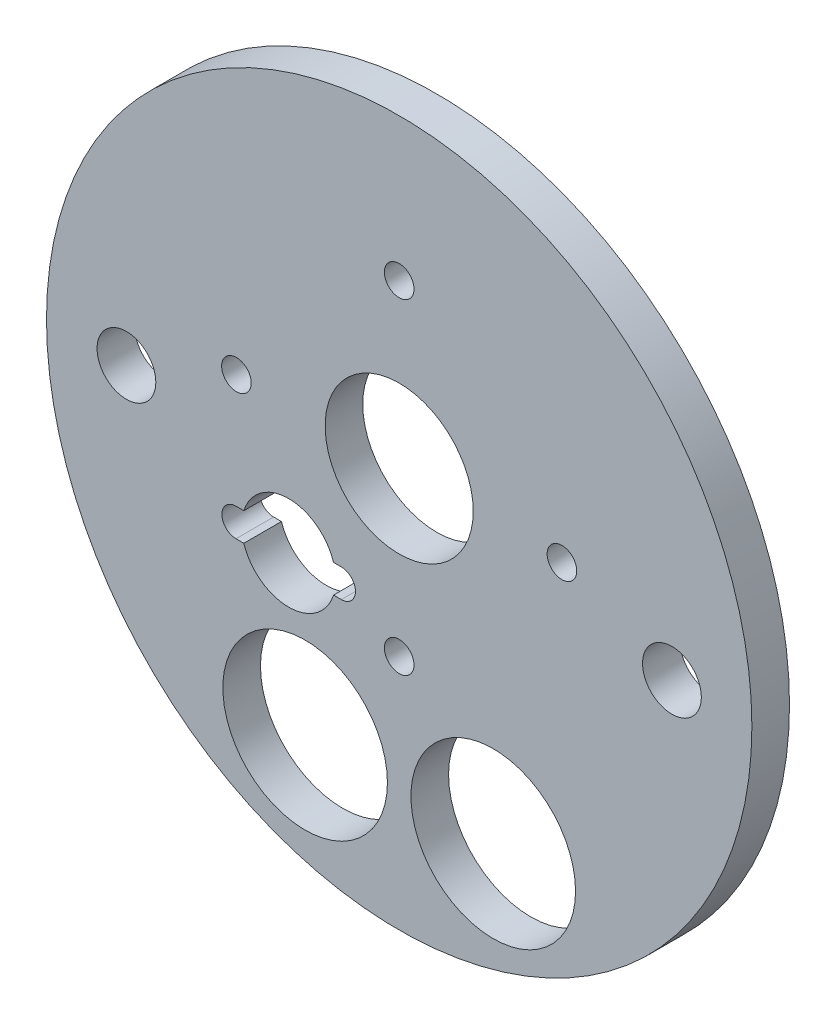
ISO-10303-21;
HEADER;
FILE_DESCRIPTION(('STEP AP214'),'2;1');
FILE_NAME('part.step','',(''),(''),'','','');
FILE_SCHEMA(('AUTOMOTIVE_DESIGN { 1 0 10303 214 1 1 1 1 }'));
ENDSEC;
DATA;
#1=APPLICATION_CONTEXT('core data for automotive mechanical design processes');
#2=APPLICATION_PROTOCOL_DEFINITION('international standard','automotive_design',2000,#1);
#3=PRODUCT_CONTEXT('',#1,'mechanical');
#4=PRODUCT('Part','Part','',(#3));
#5=PRODUCT_RELATED_PRODUCT_CATEGORY('part','',(#4));
#6=PRODUCT_DEFINITION_FORMATION('','',#4);
#7=PRODUCT_DEFINITION_CONTEXT('part definition',#1,'design');
#8=PRODUCT_DEFINITION('design','',#6,#7);
#9=PRODUCT_DEFINITION_SHAPE('','',#8);
#10=(LENGTH_UNIT() NAMED_UNIT(*) SI_UNIT(.MILLI.,.METRE.));
#11=(NAMED_UNIT(*) PLANE_ANGLE_UNIT() SI_UNIT($,.RADIAN.));
#12=(NAMED_UNIT(*) SI_UNIT($,.STERADIAN.) SOLID_ANGLE_UNIT());
#13=UNCERTAINTY_MEASURE_WITH_UNIT(LENGTH_MEASURE(1.E-05),#10,'distance_accuracy_value','');
#14=(GEOMETRIC_REPRESENTATION_CONTEXT(3) GLOBAL_UNCERTAINTY_ASSIGNED_CONTEXT((#13)) GLOBAL_UNIT_ASSIGNED_CONTEXT((#10,
#11,#12)) REPRESENTATION_CONTEXT('',''));
#15=CARTESIAN_POINT('',(0.,0.,0.));
#16=DIRECTION('',(0.,0.,1.));
#17=DIRECTION('',(1.,0.,0.));
#18=AXIS2_PLACEMENT_3D('',#15,#16,#17);
#19=CARTESIAN_POINT('',(-12.7,-31.1667936271924,0.));
#20=DIRECTION('',(0.,0.,1.));
#21=DIRECTION('',(1.,0.,0.));
#22=AXIS2_PLACEMENT_3D('',#19,#20,#21);
#23=CYLINDRICAL_SURFACE('',#22,11.1125);
#24=CARTESIAN_POINT('',(-12.7,-31.1667936271924,10.16));
#25=DIRECTION('',(0.,0.,1.));
#26=DIRECTION('',(1.,0.,0.));
#27=AXIS2_PLACEMENT_3D('',#24,#25,#26);
#28=CIRCLE('',#27,11.1125);
#29=CARTESIAN_POINT('',(-1.5875,-31.1667936271924,10.16));
#30=VERTEX_POINT('',#29);
#31=EDGE_CURVE('E43',#30,#30,#28,.T.);
#32=ORIENTED_EDGE('',*,*,#31,.T.);
#33=EDGE_LOOP('',(#32));
#34=FACE_BOUND('',#33,.T.);
#35=CARTESIAN_POINT('',(-12.7,-31.1667936271924,5.08));
#36=DIRECTION('',(0.,0.,-1.));
#37=DIRECTION('',(-1.,0.,0.));
#38=AXIS2_PLACEMENT_3D('',#35,#36,#37);
#39=CIRCLE('',#38,11.1125);
#40=CARTESIAN_POINT('',(-23.8125,-31.1667936271924,5.08));
#41=VERTEX_POINT('',#40);
#42=EDGE_CURVE('E152',#41,#41,#39,.F.);
#43=ORIENTED_EDGE('',*,*,#42,.F.);
#44=EDGE_LOOP('',(#43));
#45=FACE_BOUND('',#44,.T.);
#46=ADVANCED_FACE('F34',(#34,#45),#23,.F.);
#47=CARTESIAN_POINT('',(0.,6.35,0.));
#48=DIRECTION('',(0.,0.,1.));
#49=DIRECTION('',(1.,0.,0.));
#50=AXIS2_PLACEMENT_3D('',#47,#48,#49);
#51=CYLINDRICAL_SURFACE('',#50,10.);
#52=CARTESIAN_POINT('',(0.,6.35,10.16));
#53=DIRECTION('',(0.,0.,1.));
#54=DIRECTION('',(1.,0.,0.));
#55=AXIS2_PLACEMENT_3D('',#52,#53,#54);
#56=CIRCLE('',#55,10.);
#57=CARTESIAN_POINT('',(10.,6.35,10.16));
#58=VERTEX_POINT('',#57);
#59=EDGE_CURVE('E151',#58,#58,#56,.T.);
#60=ORIENTED_EDGE('',*,*,#59,.T.);
#61=EDGE_LOOP('',(#60));
#62=FACE_BOUND('',#61,.T.);
#63=CARTESIAN_POINT('',(0.,6.35,5.08));
#64=DIRECTION('',(0.,0.,-1.));
#65=DIRECTION('',(-1.,0.,0.));
#66=AXIS2_PLACEMENT_3D('',#63,#64,#65);
#67=CIRCLE('',#66,10.);
#68=CARTESIAN_POINT('',(-10.,6.35,5.08));
#69=VERTEX_POINT('',#68);
#70=EDGE_CURVE('E158',#69,#69,#67,.F.);
#71=ORIENTED_EDGE('',*,*,#70,.F.);
#72=EDGE_LOOP('',(#71));
#73=FACE_BOUND('',#72,.T.);
#74=ADVANCED_FACE('F235',(#62,#73),#51,.F.);
#75=CARTESIAN_POINT('',(-14.9213454566843,-10.9685752809603,0.));
#76=DIRECTION('',(0.,0.,1.));
#77=DIRECTION('',(1.,0.,0.));
#78=AXIS2_PLACEMENT_3D('',#75,#76,#77);
#79=CYLINDRICAL_SURFACE('',#78,6.35);
#80=CARTESIAN_POINT('',(-14.9213454566843,-10.9685752809603,5.08));
#81=DIRECTION('',(0.,0.,-1.));
#82=DIRECTION('',(-1.,0.,0.));
#83=AXIS2_PLACEMENT_3D('',#80,#81,#82);
#84=CIRCLE('',#83,6.35);
#85=CARTESIAN_POINT('',(-20.9788593856819,-12.8735752809603,5.08));
#86=VERTEX_POINT('',#85);
#87=CARTESIAN_POINT('',(-8.86383152768667,-12.8735752809603,5.08));
#88=VERTEX_POINT('',#87);
#89=EDGE_CURVE('E50',#86,#88,#84,.F.);
#90=ORIENTED_EDGE('',*,*,#89,.F.);
#91=DIRECTION('',(0.,0.,1.));
#92=VECTOR('',#91,1.);
#93=CARTESIAN_POINT('',(-20.9788593856819,-12.8735752809603,0.));
#94=LINE('',#93,#92);
#95=CARTESIAN_POINT('',(-20.9788593856819,-12.8735752809603,10.16));
#96=VERTEX_POINT('',#95);
#97=EDGE_CURVE('E176',#86,#96,#94,.T.);
#98=ORIENTED_EDGE('',*,*,#97,.T.);
#99=CARTESIAN_POINT('',(-14.9213454566843,-10.9685752809603,10.16));
#100=DIRECTION('',(0.,0.,1.));
#101=DIRECTION('',(1.,0.,0.));
#102=AXIS2_PLACEMENT_3D('',#99,#100,#101);
#103=CIRCLE('',#102,6.35);
#104=CARTESIAN_POINT('',(-8.86383152768667,-12.8735752809603,10.16));
#105=VERTEX_POINT('',#104);
#106=EDGE_CURVE('E171',#96,#105,#103,.T.);
#107=ORIENTED_EDGE('',*,*,#106,.T.);
#108=DIRECTION('',(0.,0.,1.));
#109=VECTOR('',#108,1.);
#110=CARTESIAN_POINT('',(-8.86383152768667,-12.8735752809603,0.));
#111=LINE('',#110,#109);
#112=EDGE_CURVE('E57',#88,#105,#111,.T.);
#113=ORIENTED_EDGE('',*,*,#112,.F.);
#114=EDGE_LOOP('',(#90,#98,#107,#113));
#115=FACE_BOUND('',#114,.T.);
#116=ADVANCED_FACE('F237',(#115),#79,.F.);
#117=CARTESIAN_POINT('',(-20.9788593856819,-12.8735752809603,0.));
#118=DIRECTION('',(0.,-1.,0.));
#119=DIRECTION('',(1.,0.,0.));
#120=AXIS2_PLACEMENT_3D('',#117,#118,#119);
#121=PLANE('',#120);
#122=DIRECTION('',(1.,0.,0.));
#123=VECTOR('',#122,1.);
#124=CARTESIAN_POINT('',(-20.9788593856819,-12.8735752809603,5.08));
#125=LINE('',#124,#123);
#126=CARTESIAN_POINT('',(-22.0333454566843,-12.8735752809603,5.08));
#127=VERTEX_POINT('',#126);
#128=EDGE_CURVE('E225',#127,#86,#125,.T.);
#129=ORIENTED_EDGE('',*,*,#128,.F.);
#130=DIRECTION('',(0.,0.,1.));
#131=VECTOR('',#130,1.);
#132=CARTESIAN_POINT('',(-22.0333454566843,-12.8735752809603,0.));
#133=LINE('',#132,#131);
#134=CARTESIAN_POINT('',(-22.0333454566843,-12.8735752809603,10.16));
#135=VERTEX_POINT('',#134);
#136=EDGE_CURVE('E196',#127,#135,#133,.T.);
#137=ORIENTED_EDGE('',*,*,#136,.T.);
#138=DIRECTION('',(1.,0.,0.));
#139=VECTOR('',#138,1.);
#140=CARTESIAN_POINT('',(-20.9788593856819,-12.8735752809603,10.16));
#141=LINE('',#140,#139);
#142=EDGE_CURVE('E122',#135,#96,#141,.T.);
#143=ORIENTED_EDGE('',*,*,#142,.T.);
#144=ORIENTED_EDGE('',*,*,#97,.F.);
#145=EDGE_LOOP('',(#129,#137,#143,#144));
#146=FACE_BOUND('',#145,.T.);
#147=ADVANCED_FACE('F244',(#146),#121,.F.);
#148=CARTESIAN_POINT('',(-22.0333454566843,-10.9685752809603,0.));
#149=DIRECTION('',(0.,0.,1.));
#150=DIRECTION('',(1.,0.,0.));
#151=AXIS2_PLACEMENT_3D('',#148,#149,#150);
#152=CYLINDRICAL_SURFACE('',#151,1.905);
#153=CARTESIAN_POINT('',(-22.0333454566843,-10.9685752809603,5.08));
#154=DIRECTION('',(0.,0.,-1.));
#155=DIRECTION('',(-1.,0.,0.));
#156=AXIS2_PLACEMENT_3D('',#153,#154,#155);
#157=CIRCLE('',#156,1.905);
#158=CARTESIAN_POINT('',(-22.0333454566843,-9.06357528096025,5.08));
#159=VERTEX_POINT('',#158);
#160=EDGE_CURVE('E223',#159,#127,#157,.F.);
#161=ORIENTED_EDGE('',*,*,#160,.F.);
#162=DIRECTION('',(0.,0.,1.));
#163=VECTOR('',#162,1.);
#164=CARTESIAN_POINT('',(-22.0333454566843,-9.06357528096025,0.));
#165=LINE('',#164,#163);
#166=CARTESIAN_POINT('',(-22.0333454566843,-9.06357528096025,10.16));
#167=VERTEX_POINT('',#166);
#168=EDGE_CURVE('E198',#159,#167,#165,.T.);
#169=ORIENTED_EDGE('',*,*,#168,.T.);
#170=CARTESIAN_POINT('',(-22.0333454566843,-10.9685752809603,10.16));
#171=DIRECTION('',(0.,0.,1.));
#172=DIRECTION('',(1.,0.,0.));
#173=AXIS2_PLACEMENT_3D('',#170,#171,#172);
#174=CIRCLE('',#173,1.905);
#175=EDGE_CURVE('E190',#167,#135,#174,.T.);
#176=ORIENTED_EDGE('',*,*,#175,.T.);
#177=ORIENTED_EDGE('',*,*,#136,.F.);
#178=EDGE_LOOP('',(#161,#169,#176,#177));
#179=FACE_BOUND('',#178,.T.);
#180=ADVANCED_FACE('F273',(#179),#152,.F.);
#181=CARTESIAN_POINT('',(-20.9788593856819,-9.06357528096025,0.));
#182=DIRECTION('',(0.,1.,0.));
#183=DIRECTION('',(-1.,0.,0.));
#184=AXIS2_PLACEMENT_3D('',#181,#182,#183);
#185=PLANE('',#184);
#186=DIRECTION('',(-1.,0.,0.));
#187=VECTOR('',#186,1.);
#188=CARTESIAN_POINT('',(-20.9788593856819,-9.06357528096025,5.08));
#189=LINE('',#188,#187);
#190=CARTESIAN_POINT('',(-20.9788593856819,-9.06357528096025,5.08));
#191=VERTEX_POINT('',#190);
#192=EDGE_CURVE('E221',#191,#159,#189,.T.);
#193=ORIENTED_EDGE('',*,*,#192,.F.);
#194=DIRECTION('',(0.,0.,1.));
#195=VECTOR('',#194,1.);
#196=CARTESIAN_POINT('',(-20.9788593856819,-9.06357528096025,0.));
#197=LINE('',#196,#195);
#198=CARTESIAN_POINT('',(-20.9788593856819,-9.06357528096025,10.16));
#199=VERTEX_POINT('',#198);
#200=EDGE_CURVE('E200',#191,#199,#197,.T.);
#201=ORIENTED_EDGE('',*,*,#200,.T.);
#202=DIRECTION('',(-1.,0.,0.));
#203=VECTOR('',#202,1.);
#204=CARTESIAN_POINT('',(-20.9788593856819,-9.06357528096025,10.16));
#205=LINE('',#204,#203);
#206=EDGE_CURVE('E187',#199,#167,#205,.T.);
#207=ORIENTED_EDGE('',*,*,#206,.T.);
#208=ORIENTED_EDGE('',*,*,#168,.F.);
#209=EDGE_LOOP('',(#193,#201,#207,#208));
#210=FACE_BOUND('',#209,.T.);
#211=ADVANCED_FACE('F220',(#210),#185,.F.);
#212=CARTESIAN_POINT('',(-14.9213454566843,-10.9685752809603,0.));
#213=DIRECTION('',(0.,0.,1.));
#214=DIRECTION('',(1.,0.,0.));
#215=AXIS2_PLACEMENT_3D('',#212,#213,#214);
#216=CYLINDRICAL_SURFACE('',#215,6.35);
#217=CARTESIAN_POINT('',(-14.9213454566843,-10.9685752809603,5.08));
#218=DIRECTION('',(0.,0.,-1.));
#219=DIRECTION('',(-1.,0.,0.));
#220=AXIS2_PLACEMENT_3D('',#217,#218,#219);
#221=CIRCLE('',#220,6.35);
#222=CARTESIAN_POINT('',(-8.86383152768667,-9.06357528096026,5.08));
#223=VERTEX_POINT('',#222);
#224=EDGE_CURVE('E208',#223,#191,#221,.F.);
#225=ORIENTED_EDGE('',*,*,#224,.F.);
#226=DIRECTION('',(0.,0.,1.));
#227=VECTOR('',#226,1.);
#228=CARTESIAN_POINT('',(-8.86383152768667,-9.06357528096026,0.));
#229=LINE('',#228,#227);
#230=CARTESIAN_POINT('',(-8.86383152768667,-9.06357528096026,10.16));
#231=VERTEX_POINT('',#230);
#232=EDGE_CURVE('E120',#223,#231,#229,.T.);
#233=ORIENTED_EDGE('',*,*,#232,.T.);
#234=CARTESIAN_POINT('',(-14.9213454566843,-10.9685752809603,10.16));
#235=DIRECTION('',(0.,0.,1.));
#236=DIRECTION('',(1.,0.,0.));
#237=AXIS2_PLACEMENT_3D('',#234,#235,#236);
#238=CIRCLE('',#237,6.35);
#239=EDGE_CURVE('E184',#231,#199,#238,.T.);
#240=ORIENTED_EDGE('',*,*,#239,.T.);
#241=ORIENTED_EDGE('',*,*,#200,.F.);
#242=EDGE_LOOP('',(#225,#233,#240,#241));
#243=FACE_BOUND('',#242,.T.);
#244=ADVANCED_FACE('F204',(#243),#216,.F.);
#245=CARTESIAN_POINT('',(-7.80934545668428,-9.06357528096025,0.));
#246=DIRECTION('',(0.,1.,0.));
#247=DIRECTION('',(-1.,0.,0.));
#248=AXIS2_PLACEMENT_3D('',#245,#246,#247);
#249=PLANE('',#248);
#250=DIRECTION('',(-1.,0.,0.));
#251=VECTOR('',#250,1.);
#252=CARTESIAN_POINT('',(-7.80934545668428,-9.06357528096025,5.08));
#253=LINE('',#252,#251);
#254=CARTESIAN_POINT('',(-7.80934545668428,-9.06357528096025,5.08));
#255=VERTEX_POINT('',#254);
#256=EDGE_CURVE('E113',#255,#223,#253,.T.);
#257=ORIENTED_EDGE('',*,*,#256,.F.);
#258=DIRECTION('',(0.,0.,1.));
#259=VECTOR('',#258,1.);
#260=CARTESIAN_POINT('',(-7.80934545668428,-9.06357528096025,0.));
#261=LINE('',#260,#259);
#262=CARTESIAN_POINT('',(-7.80934545668428,-9.06357528096025,10.16));
#263=VERTEX_POINT('',#262);
#264=EDGE_CURVE('E112',#255,#263,#261,.T.);
#265=ORIENTED_EDGE('',*,*,#264,.T.);
#266=DIRECTION('',(-1.,0.,0.));
#267=VECTOR('',#266,1.);
#268=CARTESIAN_POINT('',(-7.80934545668428,-9.06357528096025,10.16));
#269=LINE('',#268,#267);
#270=EDGE_CURVE('E181',#263,#231,#269,.T.);
#271=ORIENTED_EDGE('',*,*,#270,.T.);
#272=ORIENTED_EDGE('',*,*,#232,.F.);
#273=EDGE_LOOP('',(#257,#265,#271,#272));
#274=FACE_BOUND('',#273,.T.);
#275=ADVANCED_FACE('F211',(#274),#249,.F.);
#276=CARTESIAN_POINT('',(-7.80934545668428,-10.9685752809603,0.));
#277=DIRECTION('',(0.,0.,1.));
#278=DIRECTION('',(1.,0.,0.));
#279=AXIS2_PLACEMENT_3D('',#276,#277,#278);
#280=CYLINDRICAL_SURFACE('',#279,1.905);
#281=CARTESIAN_POINT('',(-7.80934545668428,-10.9685752809603,5.08));
#282=DIRECTION('',(0.,0.,-1.));
#283=DIRECTION('',(-1.,0.,0.));
#284=AXIS2_PLACEMENT_3D('',#281,#282,#283);
#285=CIRCLE('',#284,1.905);
#286=CARTESIAN_POINT('',(-7.80934545668428,-12.8735752809603,5.08));
#287=VERTEX_POINT('',#286);
#288=EDGE_CURVE('E102',#287,#255,#285,.F.);
#289=ORIENTED_EDGE('',*,*,#288,.F.);
#290=DIRECTION('',(0.,0.,1.));
#291=VECTOR('',#290,1.);
#292=CARTESIAN_POINT('',(-7.80934545668428,-12.8735752809603,0.));
#293=LINE('',#292,#291);
#294=CARTESIAN_POINT('',(-7.80934545668428,-12.8735752809603,10.16));
#295=VERTEX_POINT('',#294);
#296=EDGE_CURVE('E111',#287,#295,#293,.T.);
#297=ORIENTED_EDGE('',*,*,#296,.T.);
#298=CARTESIAN_POINT('',(-7.80934545668428,-10.9685752809603,10.16));
#299=DIRECTION('',(0.,0.,1.));
#300=DIRECTION('',(1.,0.,0.));
#301=AXIS2_PLACEMENT_3D('',#298,#299,#300);
#302=CIRCLE('',#301,1.905);
#303=EDGE_CURVE('E179',#295,#263,#302,.T.);
#304=ORIENTED_EDGE('',*,*,#303,.T.);
#305=ORIENTED_EDGE('',*,*,#264,.F.);
#306=EDGE_LOOP('',(#289,#297,#304,#305));
#307=FACE_BOUND('',#306,.T.);
#308=ADVANCED_FACE('F109',(#307),#280,.F.);
#309=CARTESIAN_POINT('',(-7.80934545668429,-12.8735752809603,0.));
#310=DIRECTION('',(0.,-1.,0.));
#311=DIRECTION('',(1.,0.,0.));
#312=AXIS2_PLACEMENT_3D('',#309,#310,#311);
#313=PLANE('',#312);
#314=DIRECTION('',(1.,0.,0.));
#315=VECTOR('',#314,1.);
#316=CARTESIAN_POINT('',(-7.80934545668429,-12.8735752809603,5.08));
#317=LINE('',#316,#315);
#318=EDGE_CURVE('E98',#88,#287,#317,.T.);
#319=ORIENTED_EDGE('',*,*,#318,.F.);
#320=ORIENTED_EDGE('',*,*,#112,.T.);
#321=DIRECTION('',(1.,0.,0.));
#322=VECTOR('',#321,1.);
#323=CARTESIAN_POINT('',(-7.80934545668429,-12.8735752809603,10.16));
#324=LINE('',#323,#322);
#325=EDGE_CURVE('E117',#105,#295,#324,.T.);
#326=ORIENTED_EDGE('',*,*,#325,.T.);
#327=ORIENTED_EDGE('',*,*,#296,.F.);
#328=EDGE_LOOP('',(#319,#320,#326,#327));
#329=FACE_BOUND('',#328,.T.);
#330=ADVANCED_FACE('F115',(#329),#313,.F.);
#331=CARTESIAN_POINT('',(36.83,0.,0.));
#332=DIRECTION('',(0.,0.,1.));
#333=DIRECTION('',(1.,0.,0.));
#334=AXIS2_PLACEMENT_3D('',#331,#332,#333);
#335=CYLINDRICAL_SURFACE('',#334,3.96875);
#336=CARTESIAN_POINT('',(36.83,0.,10.16));
#337=DIRECTION('',(0.,0.,1.));
#338=DIRECTION('',(1.,0.,0.));
#339=AXIS2_PLACEMENT_3D('',#336,#337,#338);
#340=CIRCLE('',#339,3.96875);
#341=CARTESIAN_POINT('',(40.79875,0.,10.16));
#342=VERTEX_POINT('',#341);
#343=EDGE_CURVE('E132',#342,#342,#340,.T.);
#344=ORIENTED_EDGE('',*,*,#343,.T.);
#345=EDGE_LOOP('',(#344));
#346=FACE_BOUND('',#345,.T.);
#347=CARTESIAN_POINT('',(36.83,0.,5.08));
#348=DIRECTION('',(0.,0.,-1.));
#349=DIRECTION('',(-1.,0.,0.));
#350=AXIS2_PLACEMENT_3D('',#347,#348,#349);
#351=CIRCLE('',#350,3.96875);
#352=CARTESIAN_POINT('',(32.86125,0.,5.08));
#353=VERTEX_POINT('',#352);
#354=EDGE_CURVE('E105',#353,#353,#351,.F.);
#355=ORIENTED_EDGE('',*,*,#354,.F.);
#356=EDGE_LOOP('',(#355));
#357=FACE_BOUND('',#356,.T.);
#358=ADVANCED_FACE('F266',(#346,#357),#335,.F.);
#359=CARTESIAN_POINT('',(-36.83,0.,0.));
#360=DIRECTION('',(0.,0.,1.));
#361=DIRECTION('',(1.,0.,0.));
#362=AXIS2_PLACEMENT_3D('',#359,#360,#361);
#363=CYLINDRICAL_SURFACE('',#362,3.96875);
#364=CARTESIAN_POINT('',(-36.83,0.,10.16));
#365=DIRECTION('',(0.,0.,1.));
#366=DIRECTION('',(1.,0.,0.));
#367=AXIS2_PLACEMENT_3D('',#364,#365,#366);
#368=CIRCLE('',#367,3.96875);
#369=CARTESIAN_POINT('',(-32.86125,0.,10.16));
#370=VERTEX_POINT('',#369);
#371=EDGE_CURVE('E129',#370,#370,#368,.T.);
#372=ORIENTED_EDGE('',*,*,#371,.T.);
#373=EDGE_LOOP('',(#372));
#374=FACE_BOUND('',#373,.T.);
#375=CARTESIAN_POINT('',(-36.83,0.,5.08));
#376=DIRECTION('',(0.,0.,-1.));
#377=DIRECTION('',(-1.,0.,0.));
#378=AXIS2_PLACEMENT_3D('',#375,#376,#377);
#379=CIRCLE('',#378,3.96875);
#380=CARTESIAN_POINT('',(-40.79875,0.,5.08));
#381=VERTEX_POINT('',#380);
#382=EDGE_CURVE('E299',#381,#381,#379,.F.);
#383=ORIENTED_EDGE('',*,*,#382,.F.);
#384=EDGE_LOOP('',(#383));
#385=FACE_BOUND('',#384,.T.);
#386=ADVANCED_FACE('F269',(#374,#385),#363,.F.);
#387=CARTESIAN_POINT('',(12.7,-31.1667936271924,0.));
#388=DIRECTION('',(0.,0.,1.));
#389=DIRECTION('',(1.,0.,0.));
#390=AXIS2_PLACEMENT_3D('',#387,#388,#389);
#391=CYLINDRICAL_SURFACE('',#390,11.1125);
#392=CARTESIAN_POINT('',(12.7,-31.1667936271924,10.16));
#393=DIRECTION('',(0.,0.,1.));
#394=DIRECTION('',(1.,0.,0.));
#395=AXIS2_PLACEMENT_3D('',#392,#393,#394);
#396=CIRCLE('',#395,11.1125);
#397=CARTESIAN_POINT('',(23.8125,-31.1667936271924,10.16));
#398=VERTEX_POINT('',#397);
#399=EDGE_CURVE('E126',#398,#398,#396,.T.);
#400=ORIENTED_EDGE('',*,*,#399,.T.);
#401=EDGE_LOOP('',(#400));
#402=FACE_BOUND('',#401,.T.);
#403=CARTESIAN_POINT('',(12.7,-31.1667936271924,5.08));
#404=DIRECTION('',(0.,0.,-1.));
#405=DIRECTION('',(-1.,0.,0.));
#406=AXIS2_PLACEMENT_3D('',#403,#404,#405);
#407=CIRCLE('',#406,11.1125);
#408=CARTESIAN_POINT('',(1.5875,-31.1667936271924,5.08));
#409=VERTEX_POINT('',#408);
#410=EDGE_CURVE('E301',#409,#409,#407,.F.);
#411=ORIENTED_EDGE('',*,*,#410,.F.);
#412=EDGE_LOOP('',(#411));
#413=FACE_BOUND('',#412,.T.);
#414=ADVANCED_FACE('F258',(#402,#413),#391,.F.);
#415=CARTESIAN_POINT('',(-21.9768787592779,6.35,0.));
#416=DIRECTION('',(0.,0.,1.));
#417=DIRECTION('',(1.,0.,0.));
#418=AXIS2_PLACEMENT_3D('',#415,#416,#417);
#419=CYLINDRICAL_SURFACE('',#418,2.);
#420=CARTESIAN_POINT('',(-21.9768787592779,6.35,10.16));
#421=DIRECTION('',(0.,0.,1.));
#422=DIRECTION('',(1.,0.,0.));
#423=AXIS2_PLACEMENT_3D('',#420,#421,#422);
#424=CIRCLE('',#423,2.);
#425=CARTESIAN_POINT('',(-19.9768787592779,6.35,10.16));
#426=VERTEX_POINT('',#425);
#427=EDGE_CURVE('E155',#426,#426,#424,.T.);
#428=ORIENTED_EDGE('',*,*,#427,.T.);
#429=EDGE_LOOP('',(#428));
#430=FACE_BOUND('',#429,.T.);
#431=CARTESIAN_POINT('',(-21.9768787592779,6.35,5.08));
#432=DIRECTION('',(0.,0.,-1.));
#433=DIRECTION('',(-1.,0.,0.));
#434=AXIS2_PLACEMENT_3D('',#431,#432,#433);
#435=CIRCLE('',#434,2.);
#436=CARTESIAN_POINT('',(-23.9768787592779,6.35,5.08));
#437=VERTEX_POINT('',#436);
#438=EDGE_CURVE('E306',#437,#437,#435,.F.);
#439=ORIENTED_EDGE('',*,*,#438,.F.);
#440=EDGE_LOOP('',(#439));
#441=FACE_BOUND('',#440,.T.);
#442=ADVANCED_FACE('F254',(#430,#441),#419,.F.);
#443=CARTESIAN_POINT('',(0.,-15.6268787592779,0.));
#444=DIRECTION('',(0.,0.,1.));
#445=DIRECTION('',(1.,0.,0.));
#446=AXIS2_PLACEMENT_3D('',#443,#444,#445);
#447=CYLINDRICAL_SURFACE('',#446,2.);
#448=CARTESIAN_POINT('',(0.,-15.6268787592779,10.16));
#449=DIRECTION('',(0.,0.,1.));
#450=DIRECTION('',(1.,0.,0.));
#451=AXIS2_PLACEMENT_3D('',#448,#449,#450);
#452=CIRCLE('',#451,2.);
#453=CARTESIAN_POINT('',(2.,-15.6268787592779,10.16));
#454=VERTEX_POINT('',#453);
#455=EDGE_CURVE('E162',#454,#454,#452,.T.);
#456=ORIENTED_EDGE('',*,*,#455,.T.);
#457=EDGE_LOOP('',(#456));
#458=FACE_BOUND('',#457,.T.);
#459=CARTESIAN_POINT('',(0.,-15.6268787592779,5.08));
#460=DIRECTION('',(0.,0.,-1.));
#461=DIRECTION('',(-1.,0.,0.));
#462=AXIS2_PLACEMENT_3D('',#459,#460,#461);
#463=CIRCLE('',#462,2.);
#464=CARTESIAN_POINT('',(-2.,-15.6268787592779,5.08));
#465=VERTEX_POINT('',#464);
#466=EDGE_CURVE('E311',#465,#465,#463,.F.);
#467=ORIENTED_EDGE('',*,*,#466,.F.);
#468=EDGE_LOOP('',(#467));
#469=FACE_BOUND('',#468,.T.);
#470=ADVANCED_FACE('F250',(#458,#469),#447,.F.);
#471=CARTESIAN_POINT('',(21.9768787592779,6.35,0.));
#472=DIRECTION('',(0.,0.,1.));
#473=DIRECTION('',(1.,0.,0.));
#474=AXIS2_PLACEMENT_3D('',#471,#472,#473);
#475=CYLINDRICAL_SURFACE('',#474,2.);
#476=CARTESIAN_POINT('',(21.9768787592779,6.35,10.16));
#477=DIRECTION('',(0.,0.,1.));
#478=DIRECTION('',(1.,0.,0.));
#479=AXIS2_PLACEMENT_3D('',#476,#477,#478);
#480=CIRCLE('',#479,2.);
#481=CARTESIAN_POINT('',(23.9768787592779,6.35,10.16));
#482=VERTEX_POINT('',#481);
#483=EDGE_CURVE('E165',#482,#482,#480,.T.);
#484=ORIENTED_EDGE('',*,*,#483,.T.);
#485=EDGE_LOOP('',(#484));
#486=FACE_BOUND('',#485,.T.);
#487=CARTESIAN_POINT('',(21.9768787592779,6.35,5.08));
#488=DIRECTION('',(0.,0.,-1.));
#489=DIRECTION('',(-1.,0.,0.));
#490=AXIS2_PLACEMENT_3D('',#487,#488,#489);
#491=CIRCLE('',#490,2.);
#492=CARTESIAN_POINT('',(19.9768787592779,6.35,5.08));
#493=VERTEX_POINT('',#492);
#494=EDGE_CURVE('E314',#493,#493,#491,.F.);
#495=ORIENTED_EDGE('',*,*,#494,.F.);
#496=EDGE_LOOP('',(#495));
#497=FACE_BOUND('',#496,.T.);
#498=ADVANCED_FACE('F253',(#486,#497),#475,.F.);
#499=CARTESIAN_POINT('',(0.,28.3268787592779,0.));
#500=DIRECTION('',(0.,0.,1.));
#501=DIRECTION('',(1.,0.,0.));
#502=AXIS2_PLACEMENT_3D('',#499,#500,#501);
#503=CYLINDRICAL_SURFACE('',#502,2.);
#504=CARTESIAN_POINT('',(0.,28.3268787592779,10.16));
#505=DIRECTION('',(0.,0.,1.));
#506=DIRECTION('',(1.,0.,0.));
#507=AXIS2_PLACEMENT_3D('',#504,#505,#506);
#508=CIRCLE('',#507,2.);
#509=CARTESIAN_POINT('',(2.,28.3268787592779,10.16));
#510=VERTEX_POINT('',#509);
#511=EDGE_CURVE('E168',#510,#510,#508,.T.);
#512=ORIENTED_EDGE('',*,*,#511,.T.);
#513=EDGE_LOOP('',(#512));
#514=FACE_BOUND('',#513,.T.);
#515=CARTESIAN_POINT('',(0.,28.3268787592779,5.08));
#516=DIRECTION('',(0.,0.,-1.));
#517=DIRECTION('',(-1.,0.,0.));
#518=AXIS2_PLACEMENT_3D('',#515,#516,#517);
#519=CIRCLE('',#518,2.);
#520=CARTESIAN_POINT('',(-2.00000000000001,28.3268787592779,5.08));
#521=VERTEX_POINT('',#520);
#522=EDGE_CURVE('E38',#521,#521,#519,.F.);
#523=ORIENTED_EDGE('',*,*,#522,.F.);
#524=EDGE_LOOP('',(#523));
#525=FACE_BOUND('',#524,.T.);
#526=ADVANCED_FACE('F146',(#514,#525),#503,.F.);
#527=CARTESIAN_POINT('',(0.,0.,10.16));
#528=DIRECTION('',(0.,0.,-1.));
#529=DIRECTION('',(-1.,0.,0.));
#530=AXIS2_PLACEMENT_3D('',#527,#528,#529);
#531=CYLINDRICAL_SURFACE('',#530,47.625);
#532=CARTESIAN_POINT('',(0.,0.,10.16));
#533=DIRECTION('',(0.,0.,1.));
#534=DIRECTION('',(1.,0.,0.));
#535=AXIS2_PLACEMENT_3D('',#532,#533,#534);
#536=CIRCLE('',#535,47.625);
#537=CARTESIAN_POINT('',(47.625,0.,10.16));
#538=VERTEX_POINT('',#537);
#539=EDGE_CURVE('E11',#538,#538,#536,.T.);
#540=ORIENTED_EDGE('',*,*,#539,.F.);
#541=EDGE_LOOP('',(#540));
#542=FACE_BOUND('',#541,.T.);
#543=CARTESIAN_POINT('',(0.,0.,5.08));
#544=DIRECTION('',(0.,0.,-1.));
#545=DIRECTION('',(-1.,0.,0.));
#546=AXIS2_PLACEMENT_3D('',#543,#544,#545);
#547=CIRCLE('',#546,47.625);
#548=CARTESIAN_POINT('',(-47.625,0.,5.08));
#549=VERTEX_POINT('',#548);
#550=EDGE_CURVE('E149',#549,#549,#547,.T.);
#551=ORIENTED_EDGE('',*,*,#550,.F.);
#552=EDGE_LOOP('',(#551));
#553=FACE_BOUND('',#552,.T.);
#554=ADVANCED_FACE('F36',(#542,#553),#531,.T.);
#555=CARTESIAN_POINT('',(0.,0.,10.16));
#556=DIRECTION('',(0.,0.,1.));
#557=DIRECTION('',(1.,0.,0.));
#558=AXIS2_PLACEMENT_3D('',#555,#556,#557);
#559=PLANE('',#558);
#560=ORIENTED_EDGE('',*,*,#511,.F.);
#561=EDGE_LOOP('',(#560));
#562=FACE_BOUND('',#561,.T.);
#563=ORIENTED_EDGE('',*,*,#483,.F.);
#564=EDGE_LOOP('',(#563));
#565=FACE_BOUND('',#564,.T.);
#566=ORIENTED_EDGE('',*,*,#455,.F.);
#567=EDGE_LOOP('',(#566));
#568=FACE_BOUND('',#567,.T.);
#569=ORIENTED_EDGE('',*,*,#427,.F.);
#570=EDGE_LOOP('',(#569));
#571=FACE_BOUND('',#570,.T.);
#572=ORIENTED_EDGE('',*,*,#399,.F.);
#573=EDGE_LOOP('',(#572));
#574=FACE_BOUND('',#573,.T.);
#575=ORIENTED_EDGE('',*,*,#371,.F.);
#576=EDGE_LOOP('',(#575));
#577=FACE_BOUND('',#576,.T.);
#578=ORIENTED_EDGE('',*,*,#343,.F.);
#579=EDGE_LOOP('',(#578));
#580=FACE_BOUND('',#579,.T.);
#581=ORIENTED_EDGE('',*,*,#106,.F.);
#582=ORIENTED_EDGE('',*,*,#142,.F.);
#583=ORIENTED_EDGE('',*,*,#175,.F.);
#584=ORIENTED_EDGE('',*,*,#206,.F.);
#585=ORIENTED_EDGE('',*,*,#239,.F.);
#586=ORIENTED_EDGE('',*,*,#270,.F.);
#587=ORIENTED_EDGE('',*,*,#303,.F.);
#588=ORIENTED_EDGE('',*,*,#325,.F.);
#589=EDGE_LOOP('',(#581,#582,#583,#584,#585,#586,#587,#588));
#590=FACE_BOUND('',#589,.T.);
#591=ORIENTED_EDGE('',*,*,#59,.F.);
#592=EDGE_LOOP('',(#591));
#593=FACE_BOUND('',#592,.T.);
#594=ORIENTED_EDGE('',*,*,#31,.F.);
#595=EDGE_LOOP('',(#594));
#596=FACE_BOUND('',#595,.T.);
#597=ORIENTED_EDGE('',*,*,#539,.T.);
#598=EDGE_LOOP('',(#597));
#599=FACE_BOUND('',#598,.T.);
#600=ADVANCED_FACE('F138',(#562,#565,#568,#571,#574,#577,#580,#590,#593,#596,#599),#559,.T.);
#601=CARTESIAN_POINT('',(0.,0.,5.08));
#602=DIRECTION('',(0.,0.,-1.));
#603=DIRECTION('',(-1.,0.,0.));
#604=AXIS2_PLACEMENT_3D('',#601,#602,#603);
#605=PLANE('',#604);
#606=ORIENTED_EDGE('',*,*,#42,.T.);
#607=EDGE_LOOP('',(#606));
#608=FACE_BOUND('',#607,.T.);
#609=ORIENTED_EDGE('',*,*,#70,.T.);
#610=EDGE_LOOP('',(#609));
#611=FACE_BOUND('',#610,.T.);
#612=ORIENTED_EDGE('',*,*,#89,.T.);
#613=ORIENTED_EDGE('',*,*,#318,.T.);
#614=ORIENTED_EDGE('',*,*,#288,.T.);
#615=ORIENTED_EDGE('',*,*,#256,.T.);
#616=ORIENTED_EDGE('',*,*,#224,.T.);
#617=ORIENTED_EDGE('',*,*,#192,.T.);
#618=ORIENTED_EDGE('',*,*,#160,.T.);
#619=ORIENTED_EDGE('',*,*,#128,.T.);
#620=EDGE_LOOP('',(#612,#613,#614,#615,#616,#617,#618,#619));
#621=FACE_BOUND('',#620,.T.);
#622=ORIENTED_EDGE('',*,*,#522,.T.);
#623=EDGE_LOOP('',(#622));
#624=FACE_BOUND('',#623,.T.);
#625=ORIENTED_EDGE('',*,*,#494,.T.);
#626=EDGE_LOOP('',(#625));
#627=FACE_BOUND('',#626,.T.);
#628=ORIENTED_EDGE('',*,*,#466,.T.);
#629=EDGE_LOOP('',(#628));
#630=FACE_BOUND('',#629,.T.);
#631=ORIENTED_EDGE('',*,*,#438,.T.);
#632=EDGE_LOOP('',(#631));
#633=FACE_BOUND('',#632,.T.);
#634=ORIENTED_EDGE('',*,*,#410,.T.);
#635=EDGE_LOOP('',(#634));
#636=FACE_BOUND('',#635,.T.);
#637=ORIENTED_EDGE('',*,*,#382,.T.);
#638=EDGE_LOOP('',(#637));
#639=FACE_BOUND('',#638,.T.);
#640=ORIENTED_EDGE('',*,*,#354,.T.);
#641=EDGE_LOOP('',(#640));
#642=FACE_BOUND('',#641,.T.);
#643=ORIENTED_EDGE('',*,*,#550,.T.);
#644=EDGE_LOOP('',(#643));
#645=FACE_BOUND('',#644,.T.);
#646=ADVANCED_FACE('F100',(#608,#611,#621,#624,#627,#630,#633,#636,#639,#642,#645),#605,.T.);
#647=CLOSED_SHELL('',(#46,#74,#116,#147,#180,#211,#244,#275,#308,#330,#358,#386,#414,#442,#470,
#498,#526,#554,#600,#646));
#648=MANIFOLD_SOLID_BREP('B2',#647);
#649=ADVANCED_BREP_SHAPE_REPRESENTATION('',(#18,#648),#14);
#650=SHAPE_DEFINITION_REPRESENTATION(#9,#649);
ENDSEC;
END-ISO-10303-21;
